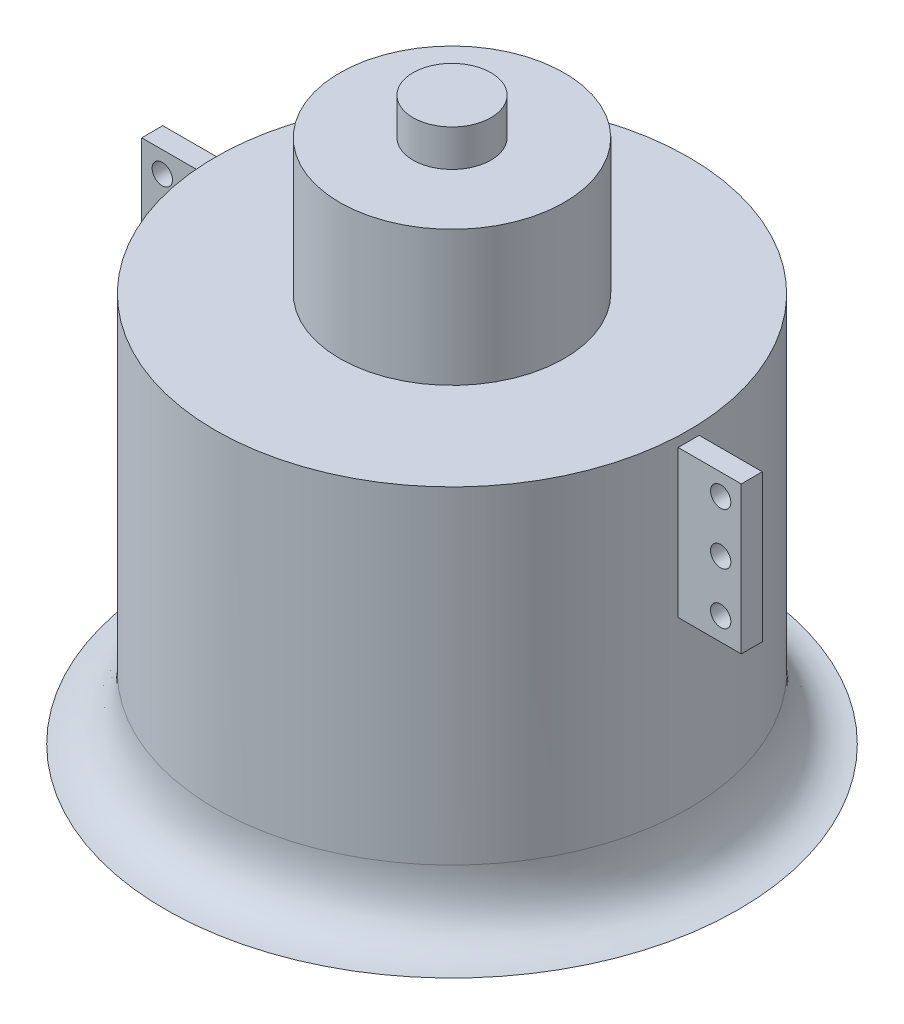
ISO-10303-21;
HEADER;
FILE_DESCRIPTION(('STEP AP214'),'2;1');
FILE_NAME('part.step','',(''),(''),'','','');
FILE_SCHEMA(('AUTOMOTIVE_DESIGN { 1 0 10303 214 1 1 1 1 }'));
ENDSEC;
DATA;
#1=APPLICATION_CONTEXT('core data for automotive mechanical design processes');
#2=APPLICATION_PROTOCOL_DEFINITION('international standard','automotive_design',2000,#1);
#3=PRODUCT_CONTEXT('',#1,'mechanical');
#4=PRODUCT('Part','Part','',(#3));
#5=PRODUCT_RELATED_PRODUCT_CATEGORY('part','',(#4));
#6=PRODUCT_DEFINITION_FORMATION('','',#4);
#7=PRODUCT_DEFINITION_CONTEXT('part definition',#1,'design');
#8=PRODUCT_DEFINITION('design','',#6,#7);
#9=PRODUCT_DEFINITION_SHAPE('','',#8);
#10=(LENGTH_UNIT() NAMED_UNIT(*) SI_UNIT(.MILLI.,.METRE.));
#11=(NAMED_UNIT(*) PLANE_ANGLE_UNIT() SI_UNIT($,.RADIAN.));
#12=(NAMED_UNIT(*) SI_UNIT($,.STERADIAN.) SOLID_ANGLE_UNIT());
#13=UNCERTAINTY_MEASURE_WITH_UNIT(LENGTH_MEASURE(1.E-05),#10,'distance_accuracy_value','');
#14=(GEOMETRIC_REPRESENTATION_CONTEXT(3) GLOBAL_UNCERTAINTY_ASSIGNED_CONTEXT((#13)) GLOBAL_UNIT_ASSIGNED_CONTEXT((#10,
#11,#12)) REPRESENTATION_CONTEXT('',''));
#15=CARTESIAN_POINT('',(0.,0.,0.));
#16=DIRECTION('',(0.,0.,1.));
#17=DIRECTION('',(1.,0.,0.));
#18=AXIS2_PLACEMENT_3D('',#15,#16,#17);
#19=CARTESIAN_POINT('',(0.,0.,2.));
#20=DIRECTION('',(0.,0.,-1.));
#21=DIRECTION('',(-1.,0.,0.));
#22=AXIS2_PLACEMENT_3D('',#19,#20,#21);
#23=PLANE('',#22);
#24=DIRECTION('',(0.,-1.,0.));
#25=VECTOR('',#24,1.);
#26=CARTESIAN_POINT('',(45.,0.,2.));
#27=LINE('',#26,#25);
#28=CARTESIAN_POINT('',(45.,28.,2.));
#29=VERTEX_POINT('',#28);
#30=CARTESIAN_POINT('',(45.,0.,2.));
#31=VERTEX_POINT('',#30);
#32=EDGE_CURVE('E99',#29,#31,#27,.T.);
#33=ORIENTED_EDGE('',*,*,#32,.T.);
#34=DIRECTION('',(1.,0.,0.));
#35=VECTOR('',#34,1.);
#36=CARTESIAN_POINT('',(57.,0.,2.));
#37=LINE('',#36,#35);
#38=CARTESIAN_POINT('',(57.,0.,2.));
#39=VERTEX_POINT('',#38);
#40=EDGE_CURVE('E94',#31,#39,#37,.T.);
#41=ORIENTED_EDGE('',*,*,#40,.T.);
#42=DIRECTION('',(0.,1.,0.));
#43=VECTOR('',#42,1.);
#44=CARTESIAN_POINT('',(57.,28.,2.));
#45=LINE('',#44,#43);
#46=CARTESIAN_POINT('',(57.,28.,2.));
#47=VERTEX_POINT('',#46);
#48=EDGE_CURVE('E97',#39,#47,#45,.T.);
#49=ORIENTED_EDGE('',*,*,#48,.T.);
#50=DIRECTION('',(-1.,0.,0.));
#51=VECTOR('',#50,1.);
#52=CARTESIAN_POINT('',(45.,28.,2.));
#53=LINE('',#52,#51);
#54=EDGE_CURVE('E64',#47,#29,#53,.T.);
#55=ORIENTED_EDGE('',*,*,#54,.T.);
#56=EDGE_LOOP('',(#33,#41,#49,#55));
#57=FACE_BOUND('',#56,.T.);
#58=CARTESIAN_POINT('',(53.09,23.97,2.));
#59=DIRECTION('',(0.,0.,1.));
#60=DIRECTION('',(1.,0.,0.));
#61=AXIS2_PLACEMENT_3D('',#58,#59,#60);
#62=CIRCLE('',#61,1.93);
#63=CARTESIAN_POINT('',(55.02,23.97,2.));
#64=VERTEX_POINT('',#63);
#65=EDGE_CURVE('E114',#64,#64,#62,.T.);
#66=ORIENTED_EDGE('',*,*,#65,.F.);
#67=EDGE_LOOP('',(#66));
#68=FACE_BOUND('',#67,.T.);
#69=CARTESIAN_POINT('',(53.09,14.145,2.));
#70=DIRECTION('',(0.,0.,1.));
#71=DIRECTION('',(1.,0.,0.));
#72=AXIS2_PLACEMENT_3D('',#69,#70,#71);
#73=CIRCLE('',#72,1.93);
#74=CARTESIAN_POINT('',(55.02,14.145,2.));
#75=VERTEX_POINT('',#74);
#76=EDGE_CURVE('E129',#75,#75,#73,.T.);
#77=ORIENTED_EDGE('',*,*,#76,.F.);
#78=EDGE_LOOP('',(#77));
#79=FACE_BOUND('',#78,.T.);
#80=CARTESIAN_POINT('',(53.09,4.33,2.));
#81=DIRECTION('',(0.,0.,1.));
#82=DIRECTION('',(1.,0.,0.));
#83=AXIS2_PLACEMENT_3D('',#80,#81,#82);
#84=CIRCLE('',#83,1.93);
#85=CARTESIAN_POINT('',(55.02,4.33,2.));
#86=VERTEX_POINT('',#85);
#87=EDGE_CURVE('E135',#86,#86,#84,.T.);
#88=ORIENTED_EDGE('',*,*,#87,.F.);
#89=EDGE_LOOP('',(#88));
#90=FACE_BOUND('',#89,.T.);
#91=ADVANCED_FACE('F47',(#57,#68,#79,#90),#23,.F.);
#92=CARTESIAN_POINT('',(0.,0.,-2.));
#93=DIRECTION('',(0.,0.,-1.));
#94=DIRECTION('',(-1.,0.,0.));
#95=AXIS2_PLACEMENT_3D('',#92,#93,#94);
#96=PLANE('',#95);
#97=CARTESIAN_POINT('',(53.09,14.145,-2.));
#98=DIRECTION('',(0.,0.,1.));
#99=DIRECTION('',(1.,0.,0.));
#100=AXIS2_PLACEMENT_3D('',#97,#98,#99);
#101=CIRCLE('',#100,1.93);
#102=CARTESIAN_POINT('',(55.02,14.145,-2.));
#103=VERTEX_POINT('',#102);
#104=EDGE_CURVE('E132',#103,#103,#101,.T.);
#105=ORIENTED_EDGE('',*,*,#104,.T.);
#106=EDGE_LOOP('',(#105));
#107=FACE_BOUND('',#106,.T.);
#108=DIRECTION('',(0.,-1.,0.));
#109=VECTOR('',#108,1.);
#110=CARTESIAN_POINT('',(45.,0.,-2.));
#111=LINE('',#110,#109);
#112=CARTESIAN_POINT('',(45.,28.,-2.));
#113=VERTEX_POINT('',#112);
#114=CARTESIAN_POINT('',(45.,0.,-2.));
#115=VERTEX_POINT('',#114);
#116=EDGE_CURVE('E111',#113,#115,#111,.T.);
#117=ORIENTED_EDGE('',*,*,#116,.F.);
#118=DIRECTION('',(-1.,0.,0.));
#119=VECTOR('',#118,1.);
#120=CARTESIAN_POINT('',(45.,28.,-2.));
#121=LINE('',#120,#119);
#122=CARTESIAN_POINT('',(57.,28.,-2.));
#123=VERTEX_POINT('',#122);
#124=EDGE_CURVE('E87',#123,#113,#121,.T.);
#125=ORIENTED_EDGE('',*,*,#124,.F.);
#126=DIRECTION('',(0.,1.,0.));
#127=VECTOR('',#126,1.);
#128=CARTESIAN_POINT('',(57.,28.,-2.));
#129=LINE('',#128,#127);
#130=CARTESIAN_POINT('',(57.,0.,-2.));
#131=VERTEX_POINT('',#130);
#132=EDGE_CURVE('E81',#131,#123,#129,.T.);
#133=ORIENTED_EDGE('',*,*,#132,.F.);
#134=DIRECTION('',(1.,0.,0.));
#135=VECTOR('',#134,1.);
#136=CARTESIAN_POINT('',(57.,0.,-2.));
#137=LINE('',#136,#135);
#138=EDGE_CURVE('E103',#115,#131,#137,.T.);
#139=ORIENTED_EDGE('',*,*,#138,.F.);
#140=EDGE_LOOP('',(#117,#125,#133,#139));
#141=FACE_BOUND('',#140,.T.);
#142=CARTESIAN_POINT('',(53.09,23.97,-2.));
#143=DIRECTION('',(0.,0.,1.));
#144=DIRECTION('',(1.,0.,0.));
#145=AXIS2_PLACEMENT_3D('',#142,#143,#144);
#146=CIRCLE('',#145,1.93);
#147=CARTESIAN_POINT('',(55.02,23.97,-2.));
#148=VERTEX_POINT('',#147);
#149=EDGE_CURVE('E126',#148,#148,#146,.T.);
#150=ORIENTED_EDGE('',*,*,#149,.T.);
#151=EDGE_LOOP('',(#150));
#152=FACE_BOUND('',#151,.T.);
#153=CARTESIAN_POINT('',(53.09,4.33,-2.));
#154=DIRECTION('',(0.,0.,1.));
#155=DIRECTION('',(1.,0.,0.));
#156=AXIS2_PLACEMENT_3D('',#153,#154,#155);
#157=CIRCLE('',#156,1.93);
#158=CARTESIAN_POINT('',(55.02,4.33,-2.));
#159=VERTEX_POINT('',#158);
#160=EDGE_CURVE('E138',#159,#159,#157,.T.);
#161=ORIENTED_EDGE('',*,*,#160,.T.);
#162=EDGE_LOOP('',(#161));
#163=FACE_BOUND('',#162,.T.);
#164=ADVANCED_FACE('F122',(#107,#141,#152,#163),#96,.T.);
#165=CARTESIAN_POINT('',(45.,0.,2.));
#166=DIRECTION('',(1.,0.,0.));
#167=DIRECTION('',(0.,0.,-1.));
#168=AXIS2_PLACEMENT_3D('',#165,#166,#167);
#169=PLANE('',#168);
#170=ORIENTED_EDGE('',*,*,#116,.T.);
#171=DIRECTION('',(0.,0.,-1.));
#172=VECTOR('',#171,1.);
#173=CARTESIAN_POINT('',(45.,0.,2.));
#174=LINE('',#173,#172);
#175=EDGE_CURVE('E12',#31,#115,#174,.T.);
#176=ORIENTED_EDGE('',*,*,#175,.F.);
#177=ORIENTED_EDGE('',*,*,#32,.F.);
#178=DIRECTION('',(0.,0.,-1.));
#179=VECTOR('',#178,1.);
#180=CARTESIAN_POINT('',(45.,28.,2.));
#181=LINE('',#180,#179);
#182=EDGE_CURVE('E107',#29,#113,#181,.T.);
#183=ORIENTED_EDGE('',*,*,#182,.T.);
#184=EDGE_LOOP('',(#170,#176,#177,#183));
#185=FACE_BOUND('',#184,.T.);
#186=ADVANCED_FACE('F49',(#185),#169,.F.);
#187=CARTESIAN_POINT('',(57.,0.,2.));
#188=DIRECTION('',(0.,1.,0.));
#189=DIRECTION('',(-1.,0.,0.));
#190=AXIS2_PLACEMENT_3D('',#187,#188,#189);
#191=PLANE('',#190);
#192=ORIENTED_EDGE('',*,*,#138,.T.);
#193=DIRECTION('',(0.,0.,-1.));
#194=VECTOR('',#193,1.);
#195=CARTESIAN_POINT('',(57.,0.,2.));
#196=LINE('',#195,#194);
#197=EDGE_CURVE('E56',#39,#131,#196,.T.);
#198=ORIENTED_EDGE('',*,*,#197,.F.);
#199=ORIENTED_EDGE('',*,*,#40,.F.);
#200=ORIENTED_EDGE('',*,*,#175,.T.);
#201=EDGE_LOOP('',(#192,#198,#199,#200));
#202=FACE_BOUND('',#201,.T.);
#203=ADVANCED_FACE('F102',(#202),#191,.F.);
#204=CARTESIAN_POINT('',(57.,28.,2.));
#205=DIRECTION('',(-1.,0.,0.));
#206=DIRECTION('',(0.,0.,1.));
#207=AXIS2_PLACEMENT_3D('',#204,#205,#206);
#208=PLANE('',#207);
#209=ORIENTED_EDGE('',*,*,#132,.T.);
#210=DIRECTION('',(0.,0.,-1.));
#211=VECTOR('',#210,1.);
#212=CARTESIAN_POINT('',(57.,28.,2.));
#213=LINE('',#212,#211);
#214=EDGE_CURVE('E104',#47,#123,#213,.T.);
#215=ORIENTED_EDGE('',*,*,#214,.F.);
#216=ORIENTED_EDGE('',*,*,#48,.F.);
#217=ORIENTED_EDGE('',*,*,#197,.T.);
#218=EDGE_LOOP('',(#209,#215,#216,#217));
#219=FACE_BOUND('',#218,.T.);
#220=ADVANCED_FACE('F105',(#219),#208,.F.);
#221=CARTESIAN_POINT('',(45.,28.,2.));
#222=DIRECTION('',(0.,-1.,0.));
#223=DIRECTION('',(1.,0.,0.));
#224=AXIS2_PLACEMENT_3D('',#221,#222,#223);
#225=PLANE('',#224);
#226=ORIENTED_EDGE('',*,*,#124,.T.);
#227=ORIENTED_EDGE('',*,*,#182,.F.);
#228=ORIENTED_EDGE('',*,*,#54,.F.);
#229=ORIENTED_EDGE('',*,*,#214,.T.);
#230=EDGE_LOOP('',(#226,#227,#228,#229));
#231=FACE_BOUND('',#230,.T.);
#232=ADVANCED_FACE('F119',(#231),#225,.F.);
#233=CARTESIAN_POINT('',(53.09,23.97,2.));
#234=DIRECTION('',(0.,0.,-1.));
#235=DIRECTION('',(-1.,0.,0.));
#236=AXIS2_PLACEMENT_3D('',#233,#234,#235);
#237=CYLINDRICAL_SURFACE('',#236,1.93);
#238=ORIENTED_EDGE('',*,*,#65,.T.);
#239=EDGE_LOOP('',(#238));
#240=FACE_BOUND('',#239,.T.);
#241=ORIENTED_EDGE('',*,*,#149,.F.);
#242=EDGE_LOOP('',(#241));
#243=FACE_BOUND('',#242,.T.);
#244=ADVANCED_FACE('F155',(#240,#243),#237,.F.);
#245=CARTESIAN_POINT('',(53.09,14.145,2.));
#246=DIRECTION('',(0.,0.,-1.));
#247=DIRECTION('',(-1.,0.,0.));
#248=AXIS2_PLACEMENT_3D('',#245,#246,#247);
#249=CYLINDRICAL_SURFACE('',#248,1.93);
#250=ORIENTED_EDGE('',*,*,#76,.T.);
#251=EDGE_LOOP('',(#250));
#252=FACE_BOUND('',#251,.T.);
#253=ORIENTED_EDGE('',*,*,#104,.F.);
#254=EDGE_LOOP('',(#253));
#255=FACE_BOUND('',#254,.T.);
#256=ADVANCED_FACE('F201',(#252,#255),#249,.F.);
#257=CARTESIAN_POINT('',(53.09,4.33,2.));
#258=DIRECTION('',(0.,0.,-1.));
#259=DIRECTION('',(-1.,0.,0.));
#260=AXIS2_PLACEMENT_3D('',#257,#258,#259);
#261=CYLINDRICAL_SURFACE('',#260,1.93);
#262=ORIENTED_EDGE('',*,*,#87,.T.);
#263=EDGE_LOOP('',(#262));
#264=FACE_BOUND('',#263,.T.);
#265=ORIENTED_EDGE('',*,*,#160,.F.);
#266=EDGE_LOOP('',(#265));
#267=FACE_BOUND('',#266,.T.);
#268=ADVANCED_FACE('F144',(#264,#267),#261,.F.);
#269=CLOSED_SHELL('',(#91,#164,#186,#203,#220,#232,#244,#256,#268));
#270=MANIFOLD_SOLID_BREP('B2',#269);
#271=CARTESIAN_POINT('',(0.,0.,2.));
#272=DIRECTION('',(0.,0.,1.));
#273=DIRECTION('',(1.,0.,0.));
#274=AXIS2_PLACEMENT_3D('',#271,#272,#273);
#275=PLANE('',#274);
#276=CARTESIAN_POINT('',(-53.09,14.1450000000001,2.));
#277=DIRECTION('',(0.,0.,1.));
#278=DIRECTION('',(-1.,0.,0.));
#279=AXIS2_PLACEMENT_3D('',#276,#277,#278);
#280=CIRCLE('',#279,1.93);
#281=CARTESIAN_POINT('',(-55.02,14.1450000000001,2.));
#282=VERTEX_POINT('',#281);
#283=EDGE_CURVE('E322',#282,#282,#280,.T.);
#284=ORIENTED_EDGE('',*,*,#283,.F.);
#285=EDGE_LOOP('',(#284));
#286=FACE_BOUND('',#285,.T.);
#287=DIRECTION('',(0.,1.,0.));
#288=VECTOR('',#287,1.);
#289=CARTESIAN_POINT('',(-45.,0.,2.));
#290=LINE('',#289,#288);
#291=CARTESIAN_POINT('',(-45.,0.,2.));
#292=VERTEX_POINT('',#291);
#293=CARTESIAN_POINT('',(-45.,28.,2.));
#294=VERTEX_POINT('',#293);
#295=EDGE_CURVE('E292',#292,#294,#290,.T.);
#296=ORIENTED_EDGE('',*,*,#295,.T.);
#297=DIRECTION('',(-1.,0.,0.));
#298=VECTOR('',#297,1.);
#299=CARTESIAN_POINT('',(-45.,28.,2.));
#300=LINE('',#299,#298);
#301=CARTESIAN_POINT('',(-57.,28.,2.));
#302=VERTEX_POINT('',#301);
#303=EDGE_CURVE('E287',#294,#302,#300,.T.);
#304=ORIENTED_EDGE('',*,*,#303,.T.);
#305=DIRECTION('',(0.,-1.,0.));
#306=VECTOR('',#305,1.);
#307=CARTESIAN_POINT('',(-57.,28.,2.));
#308=LINE('',#307,#306);
#309=CARTESIAN_POINT('',(-57.,0.,2.));
#310=VERTEX_POINT('',#309);
#311=EDGE_CURVE('E290',#302,#310,#308,.T.);
#312=ORIENTED_EDGE('',*,*,#311,.T.);
#313=DIRECTION('',(1.,0.,0.));
#314=VECTOR('',#313,1.);
#315=CARTESIAN_POINT('',(-57.,0.,2.));
#316=LINE('',#315,#314);
#317=EDGE_CURVE('E257',#310,#292,#316,.T.);
#318=ORIENTED_EDGE('',*,*,#317,.T.);
#319=EDGE_LOOP('',(#296,#304,#312,#318));
#320=FACE_BOUND('',#319,.T.);
#321=CARTESIAN_POINT('',(-53.09,4.33000000000009,2.));
#322=DIRECTION('',(0.,0.,1.));
#323=DIRECTION('',(-1.,0.,0.));
#324=AXIS2_PLACEMENT_3D('',#321,#322,#323);
#325=CIRCLE('',#324,1.93);
#326=CARTESIAN_POINT('',(-55.02,4.33000000000009,2.));
#327=VERTEX_POINT('',#326);
#328=EDGE_CURVE('E307',#327,#327,#325,.T.);
#329=ORIENTED_EDGE('',*,*,#328,.F.);
#330=EDGE_LOOP('',(#329));
#331=FACE_BOUND('',#330,.T.);
#332=CARTESIAN_POINT('',(-53.09,23.9700000000001,2.));
#333=DIRECTION('',(0.,0.,1.));
#334=DIRECTION('',(-1.,0.,0.));
#335=AXIS2_PLACEMENT_3D('',#332,#333,#334);
#336=CIRCLE('',#335,1.93);
#337=CARTESIAN_POINT('',(-55.02,23.9700000000001,2.));
#338=VERTEX_POINT('',#337);
#339=EDGE_CURVE('E328',#338,#338,#336,.T.);
#340=ORIENTED_EDGE('',*,*,#339,.F.);
#341=EDGE_LOOP('',(#340));
#342=FACE_BOUND('',#341,.T.);
#343=ADVANCED_FACE('F240',(#286,#320,#331,#342),#275,.T.);
#344=CARTESIAN_POINT('',(0.,0.,-2.));
#345=DIRECTION('',(0.,0.,1.));
#346=DIRECTION('',(1.,0.,0.));
#347=AXIS2_PLACEMENT_3D('',#344,#345,#346);
#348=PLANE('',#347);
#349=DIRECTION('',(0.,1.,0.));
#350=VECTOR('',#349,1.);
#351=CARTESIAN_POINT('',(-45.,0.,-2.));
#352=LINE('',#351,#350);
#353=CARTESIAN_POINT('',(-45.,0.,-2.));
#354=VERTEX_POINT('',#353);
#355=CARTESIAN_POINT('',(-45.,28.,-2.));
#356=VERTEX_POINT('',#355);
#357=EDGE_CURVE('E304',#354,#356,#352,.T.);
#358=ORIENTED_EDGE('',*,*,#357,.F.);
#359=DIRECTION('',(1.,0.,0.));
#360=VECTOR('',#359,1.);
#361=CARTESIAN_POINT('',(-57.,0.,-2.));
#362=LINE('',#361,#360);
#363=CARTESIAN_POINT('',(-57.,0.,-2.));
#364=VERTEX_POINT('',#363);
#365=EDGE_CURVE('E280',#364,#354,#362,.T.);
#366=ORIENTED_EDGE('',*,*,#365,.F.);
#367=DIRECTION('',(0.,-1.,0.));
#368=VECTOR('',#367,1.);
#369=CARTESIAN_POINT('',(-57.,28.,-2.));
#370=LINE('',#369,#368);
#371=CARTESIAN_POINT('',(-57.,28.,-2.));
#372=VERTEX_POINT('',#371);
#373=EDGE_CURVE('E274',#372,#364,#370,.T.);
#374=ORIENTED_EDGE('',*,*,#373,.F.);
#375=DIRECTION('',(-1.,0.,0.));
#376=VECTOR('',#375,1.);
#377=CARTESIAN_POINT('',(-45.,28.,-2.));
#378=LINE('',#377,#376);
#379=EDGE_CURVE('E296',#356,#372,#378,.T.);
#380=ORIENTED_EDGE('',*,*,#379,.F.);
#381=EDGE_LOOP('',(#358,#366,#374,#380));
#382=FACE_BOUND('',#381,.T.);
#383=CARTESIAN_POINT('',(-53.09,4.33000000000009,-2.));
#384=DIRECTION('',(0.,0.,1.));
#385=DIRECTION('',(-1.,0.,0.));
#386=AXIS2_PLACEMENT_3D('',#383,#384,#385);
#387=CIRCLE('',#386,1.93);
#388=CARTESIAN_POINT('',(-55.02,4.33000000000009,-2.));
#389=VERTEX_POINT('',#388);
#390=EDGE_CURVE('E319',#389,#389,#387,.T.);
#391=ORIENTED_EDGE('',*,*,#390,.T.);
#392=EDGE_LOOP('',(#391));
#393=FACE_BOUND('',#392,.T.);
#394=CARTESIAN_POINT('',(-53.09,14.1450000000001,-2.));
#395=DIRECTION('',(0.,0.,1.));
#396=DIRECTION('',(-1.,0.,0.));
#397=AXIS2_PLACEMENT_3D('',#394,#395,#396);
#398=CIRCLE('',#397,1.93);
#399=CARTESIAN_POINT('',(-55.02,14.1450000000001,-2.));
#400=VERTEX_POINT('',#399);
#401=EDGE_CURVE('E325',#400,#400,#398,.T.);
#402=ORIENTED_EDGE('',*,*,#401,.T.);
#403=EDGE_LOOP('',(#402));
#404=FACE_BOUND('',#403,.T.);
#405=CARTESIAN_POINT('',(-53.09,23.9700000000001,-2.));
#406=DIRECTION('',(0.,0.,1.));
#407=DIRECTION('',(-1.,0.,0.));
#408=AXIS2_PLACEMENT_3D('',#405,#406,#407);
#409=CIRCLE('',#408,1.93);
#410=CARTESIAN_POINT('',(-55.02,23.9700000000001,-2.));
#411=VERTEX_POINT('',#410);
#412=EDGE_CURVE('E331',#411,#411,#409,.T.);
#413=ORIENTED_EDGE('',*,*,#412,.T.);
#414=EDGE_LOOP('',(#413));
#415=FACE_BOUND('',#414,.T.);
#416=ADVANCED_FACE('F315',(#382,#393,#404,#415),#348,.F.);
#417=CARTESIAN_POINT('',(-45.,0.,2.));
#418=DIRECTION('',(-1.,0.,0.));
#419=DIRECTION('',(0.,0.,1.));
#420=AXIS2_PLACEMENT_3D('',#417,#418,#419);
#421=PLANE('',#420);
#422=ORIENTED_EDGE('',*,*,#357,.T.);
#423=DIRECTION('',(0.,0.,-1.));
#424=VECTOR('',#423,1.);
#425=CARTESIAN_POINT('',(-45.,28.,2.));
#426=LINE('',#425,#424);
#427=EDGE_CURVE('E45',#294,#356,#426,.T.);
#428=ORIENTED_EDGE('',*,*,#427,.F.);
#429=ORIENTED_EDGE('',*,*,#295,.F.);
#430=DIRECTION('',(0.,0.,-1.));
#431=VECTOR('',#430,1.);
#432=CARTESIAN_POINT('',(-45.,0.,2.));
#433=LINE('',#432,#431);
#434=EDGE_CURVE('E300',#292,#354,#433,.T.);
#435=ORIENTED_EDGE('',*,*,#434,.T.);
#436=EDGE_LOOP('',(#422,#428,#429,#435));
#437=FACE_BOUND('',#436,.T.);
#438=ADVANCED_FACE('F242',(#437),#421,.F.);
#439=CARTESIAN_POINT('',(-45.,28.,2.));
#440=DIRECTION('',(0.,-1.,0.));
#441=DIRECTION('',(1.,0.,0.));
#442=AXIS2_PLACEMENT_3D('',#439,#440,#441);
#443=PLANE('',#442);
#444=ORIENTED_EDGE('',*,*,#379,.T.);
#445=DIRECTION('',(0.,0.,-1.));
#446=VECTOR('',#445,1.);
#447=CARTESIAN_POINT('',(-57.,28.,2.));
#448=LINE('',#447,#446);
#449=EDGE_CURVE('E249',#302,#372,#448,.T.);
#450=ORIENTED_EDGE('',*,*,#449,.F.);
#451=ORIENTED_EDGE('',*,*,#303,.F.);
#452=ORIENTED_EDGE('',*,*,#427,.T.);
#453=EDGE_LOOP('',(#444,#450,#451,#452));
#454=FACE_BOUND('',#453,.T.);
#455=ADVANCED_FACE('F295',(#454),#443,.F.);
#456=CARTESIAN_POINT('',(-57.,28.,2.));
#457=DIRECTION('',(1.,0.,0.));
#458=DIRECTION('',(0.,0.,-1.));
#459=AXIS2_PLACEMENT_3D('',#456,#457,#458);
#460=PLANE('',#459);
#461=ORIENTED_EDGE('',*,*,#373,.T.);
#462=DIRECTION('',(0.,0.,-1.));
#463=VECTOR('',#462,1.);
#464=CARTESIAN_POINT('',(-57.,0.,2.));
#465=LINE('',#464,#463);
#466=EDGE_CURVE('E297',#310,#364,#465,.T.);
#467=ORIENTED_EDGE('',*,*,#466,.F.);
#468=ORIENTED_EDGE('',*,*,#311,.F.);
#469=ORIENTED_EDGE('',*,*,#449,.T.);
#470=EDGE_LOOP('',(#461,#467,#468,#469));
#471=FACE_BOUND('',#470,.T.);
#472=ADVANCED_FACE('F298',(#471),#460,.F.);
#473=CARTESIAN_POINT('',(-57.,0.,2.));
#474=DIRECTION('',(0.,1.,0.));
#475=DIRECTION('',(-1.,0.,0.));
#476=AXIS2_PLACEMENT_3D('',#473,#474,#475);
#477=PLANE('',#476);
#478=ORIENTED_EDGE('',*,*,#365,.T.);
#479=ORIENTED_EDGE('',*,*,#434,.F.);
#480=ORIENTED_EDGE('',*,*,#317,.F.);
#481=ORIENTED_EDGE('',*,*,#466,.T.);
#482=EDGE_LOOP('',(#478,#479,#480,#481));
#483=FACE_BOUND('',#482,.T.);
#484=ADVANCED_FACE('F312',(#483),#477,.F.);
#485=CARTESIAN_POINT('',(-53.09,4.33000000000009,2.));
#486=DIRECTION('',(0.,0.,-1.));
#487=DIRECTION('',(-1.,0.,0.));
#488=AXIS2_PLACEMENT_3D('',#485,#486,#487);
#489=CYLINDRICAL_SURFACE('',#488,1.93);
#490=ORIENTED_EDGE('',*,*,#328,.T.);
#491=EDGE_LOOP('',(#490));
#492=FACE_BOUND('',#491,.T.);
#493=ORIENTED_EDGE('',*,*,#390,.F.);
#494=EDGE_LOOP('',(#493));
#495=FACE_BOUND('',#494,.T.);
#496=ADVANCED_FACE('F349',(#492,#495),#489,.F.);
#497=CARTESIAN_POINT('',(-53.09,14.1450000000001,2.));
#498=DIRECTION('',(0.,0.,-1.));
#499=DIRECTION('',(-1.,0.,0.));
#500=AXIS2_PLACEMENT_3D('',#497,#498,#499);
#501=CYLINDRICAL_SURFACE('',#500,1.93);
#502=ORIENTED_EDGE('',*,*,#283,.T.);
#503=EDGE_LOOP('',(#502));
#504=FACE_BOUND('',#503,.T.);
#505=ORIENTED_EDGE('',*,*,#401,.F.);
#506=EDGE_LOOP('',(#505));
#507=FACE_BOUND('',#506,.T.);
#508=ADVANCED_FACE('F395',(#504,#507),#501,.F.);
#509=CARTESIAN_POINT('',(-53.09,23.9700000000001,2.));
#510=DIRECTION('',(0.,0.,-1.));
#511=DIRECTION('',(-1.,0.,0.));
#512=AXIS2_PLACEMENT_3D('',#509,#510,#511);
#513=CYLINDRICAL_SURFACE('',#512,1.93);
#514=ORIENTED_EDGE('',*,*,#339,.T.);
#515=EDGE_LOOP('',(#514));
#516=FACE_BOUND('',#515,.T.);
#517=ORIENTED_EDGE('',*,*,#412,.F.);
#518=EDGE_LOOP('',(#517));
#519=FACE_BOUND('',#518,.T.);
#520=ADVANCED_FACE('F337',(#516,#519),#513,.F.);
#521=CLOSED_SHELL('',(#343,#416,#438,#455,#472,#484,#496,#508,#520));
#522=MANIFOLD_SOLID_BREP('B6',#521);
#523=CARTESIAN_POINT('',(0.,29.82,0.));
#524=DIRECTION('',(0.,-1.,0.));
#525=DIRECTION('',(0.,0.,-1.));
#526=AXIS2_PLACEMENT_3D('',#523,#524,#525);
#527=CYLINDRICAL_SURFACE('',#526,45.);
#528=CARTESIAN_POINT('',(0.,29.82,0.));
#529=DIRECTION('',(0.,1.,0.));
#530=DIRECTION('',(0.,0.,1.));
#531=AXIS2_PLACEMENT_3D('',#528,#529,#530);
#532=CIRCLE('',#531,45.);
#533=CARTESIAN_POINT('',(0.,29.82,45.));
#534=VERTEX_POINT('',#533);
#535=EDGE_CURVE('E430',#534,#534,#532,.T.);
#536=ORIENTED_EDGE('',*,*,#535,.F.);
#537=EDGE_LOOP('',(#536));
#538=FACE_BOUND('',#537,.T.);
#539=CARTESIAN_POINT('',(0.,-32.46,0.));
#540=DIRECTION('',(0.,-1.,0.));
#541=DIRECTION('',(0.,0.,-1.));
#542=AXIS2_PLACEMENT_3D('',#539,#540,#541);
#543=CIRCLE('',#542,45.);
#544=CARTESIAN_POINT('',(0.,-32.46,-45.));
#545=VERTEX_POINT('',#544);
#546=EDGE_CURVE('E449',#545,#545,#543,.T.);
#547=ORIENTED_EDGE('',*,*,#546,.F.);
#548=EDGE_LOOP('',(#547));
#549=FACE_BOUND('',#548,.T.);
#550=ADVANCED_FACE('F427',(#538,#549),#527,.T.);
#551=CARTESIAN_POINT('',(0.,29.82,0.));
#552=DIRECTION('',(0.,1.,0.));
#553=DIRECTION('',(0.,0.,1.));
#554=AXIS2_PLACEMENT_3D('',#551,#552,#553);
#555=PLANE('',#554);
#556=CARTESIAN_POINT('',(0.,29.82,0.));
#557=DIRECTION('',(0.,1.,0.));
#558=DIRECTION('',(0.,0.,1.));
#559=AXIS2_PLACEMENT_3D('',#556,#557,#558);
#560=CIRCLE('',#559,21.35);
#561=CARTESIAN_POINT('',(0.,29.82,21.35));
#562=VERTEX_POINT('',#561);
#563=EDGE_CURVE('E434',#562,#562,#560,.T.);
#564=ORIENTED_EDGE('',*,*,#563,.F.);
#565=EDGE_LOOP('',(#564));
#566=FACE_BOUND('',#565,.T.);
#567=ORIENTED_EDGE('',*,*,#535,.T.);
#568=EDGE_LOOP('',(#567));
#569=FACE_BOUND('',#568,.T.);
#570=ADVANCED_FACE('F485',(#566,#569),#555,.T.);
#571=CARTESIAN_POINT('',(0.,55.52,0.));
#572=DIRECTION('',(0.,-1.,0.));
#573=DIRECTION('',(0.,0.,-1.));
#574=AXIS2_PLACEMENT_3D('',#571,#572,#573);
#575=CYLINDRICAL_SURFACE('',#574,21.35);
#576=CARTESIAN_POINT('',(0.,55.52,0.));
#577=DIRECTION('',(0.,1.,0.));
#578=DIRECTION('',(0.,0.,1.));
#579=AXIS2_PLACEMENT_3D('',#576,#577,#578);
#580=CIRCLE('',#579,21.35);
#581=CARTESIAN_POINT('',(0.,55.52,21.35));
#582=VERTEX_POINT('',#581);
#583=EDGE_CURVE('E443',#582,#582,#580,.T.);
#584=ORIENTED_EDGE('',*,*,#583,.F.);
#585=EDGE_LOOP('',(#584));
#586=FACE_BOUND('',#585,.T.);
#587=ORIENTED_EDGE('',*,*,#563,.T.);
#588=EDGE_LOOP('',(#587));
#589=FACE_BOUND('',#588,.T.);
#590=ADVANCED_FACE('F482',(#586,#589),#575,.T.);
#591=CARTESIAN_POINT('',(0.,55.52,0.));
#592=DIRECTION('',(0.,1.,0.));
#593=DIRECTION('',(0.,0.,1.));
#594=AXIS2_PLACEMENT_3D('',#591,#592,#593);
#595=PLANE('',#594);
#596=CARTESIAN_POINT('',(0.,55.52,0.));
#597=DIRECTION('',(0.,1.,0.));
#598=DIRECTION('',(0.,0.,1.));
#599=AXIS2_PLACEMENT_3D('',#596,#597,#598);
#600=CIRCLE('',#599,7.41);
#601=CARTESIAN_POINT('',(0.,55.52,7.41));
#602=VERTEX_POINT('',#601);
#603=EDGE_CURVE('E239',#602,#602,#600,.T.);
#604=ORIENTED_EDGE('',*,*,#603,.F.);
#605=EDGE_LOOP('',(#604));
#606=FACE_BOUND('',#605,.T.);
#607=ORIENTED_EDGE('',*,*,#583,.T.);
#608=EDGE_LOOP('',(#607));
#609=FACE_BOUND('',#608,.T.);
#610=ADVANCED_FACE('F478',(#606,#609),#595,.T.);
#611=CARTESIAN_POINT('',(0.,62.52,0.));
#612=DIRECTION('',(0.,-1.,0.));
#613=DIRECTION('',(0.,0.,-1.));
#614=AXIS2_PLACEMENT_3D('',#611,#612,#613);
#615=CYLINDRICAL_SURFACE('',#614,7.41);
#616=CARTESIAN_POINT('',(0.,62.52,0.));
#617=DIRECTION('',(0.,1.,0.));
#618=DIRECTION('',(0.,0.,1.));
#619=AXIS2_PLACEMENT_3D('',#616,#617,#618);
#620=CIRCLE('',#619,7.41);
#621=CARTESIAN_POINT('',(0.,62.52,7.41));
#622=VERTEX_POINT('',#621);
#623=EDGE_CURVE('E441',#622,#622,#620,.T.);
#624=ORIENTED_EDGE('',*,*,#623,.F.);
#625=EDGE_LOOP('',(#624));
#626=FACE_BOUND('',#625,.T.);
#627=ORIENTED_EDGE('',*,*,#603,.T.);
#628=EDGE_LOOP('',(#627));
#629=FACE_BOUND('',#628,.T.);
#630=ADVANCED_FACE('F475',(#626,#629),#615,.T.);
#631=CARTESIAN_POINT('',(0.,62.52,0.));
#632=DIRECTION('',(0.,1.,0.));
#633=DIRECTION('',(0.,0.,1.));
#634=AXIS2_PLACEMENT_3D('',#631,#632,#633);
#635=PLANE('',#634);
#636=ORIENTED_EDGE('',*,*,#623,.T.);
#637=EDGE_LOOP('',(#636));
#638=FACE_BOUND('',#637,.T.);
#639=ADVANCED_FACE('F471',(#638),#635,.T.);
#640=CARTESIAN_POINT('',(-45.,-32.46,0.));
#641=CARTESIAN_POINT('',(-45.,-44.34,0.));
#642=CARTESIAN_POINT('',(-54.5,-44.34,0.));
#643=B_SPLINE_CURVE_WITH_KNOTS('',2,(#640,#641,#642),.UNSPECIFIED.,.F.,.F.,(3,3),(0.,1.),.UNSPECIFIED.);
#644=CARTESIAN_POINT('',(0.,-44.34,0.));
#645=DIRECTION('',(0.,-1.,0.));
#646=AXIS1_PLACEMENT('',#644,#645);
#647=SURFACE_OF_REVOLUTION('',#643,#646);
#648=CARTESIAN_POINT('',(0.,-44.3399999999999,0.));
#649=DIRECTION('',(0.,-1.,0.));
#650=DIRECTION('',(1.,0.,0.));
#651=AXIS2_PLACEMENT_3D('',#648,#649,#650);
#652=CIRCLE('',#651,54.5);
#653=CARTESIAN_POINT('',(54.5,-44.3399999999999,0.));
#654=VERTEX_POINT('',#653);
#655=EDGE_CURVE('E453',#654,#654,#652,.T.);
#656=ORIENTED_EDGE('',*,*,#655,.F.);
#657=EDGE_LOOP('',(#656));
#658=FACE_BOUND('',#657,.T.);
#659=ORIENTED_EDGE('',*,*,#546,.T.);
#660=EDGE_LOOP('',(#659));
#661=FACE_BOUND('',#660,.T.);
#662=ADVANCED_FACE('F466',(#658,#661),#647,.T.);
#663=CARTESIAN_POINT('',(-54.5,-44.34,0.));
#664=DIRECTION('',(0.,1.,0.));
#665=DIRECTION('',(-1.,0.,0.));
#666=AXIS2_PLACEMENT_3D('',#663,#664,#665);
#667=PLANE('',#666);
#668=ORIENTED_EDGE('',*,*,#655,.T.);
#669=EDGE_LOOP('',(#668));
#670=FACE_BOUND('',#669,.T.);
#671=ADVANCED_FACE('F470',(#670),#667,.F.);
#672=CLOSED_SHELL('',(#550,#570,#590,#610,#630,#639,#662,#671));
#673=MANIFOLD_SOLID_BREP('B39',#672);
#674=ADVANCED_BREP_SHAPE_REPRESENTATION('',(#18,#270,#522,#673),#14);
#675=SHAPE_DEFINITION_REPRESENTATION(#9,#674);
ENDSEC;
END-ISO-10303-21;
